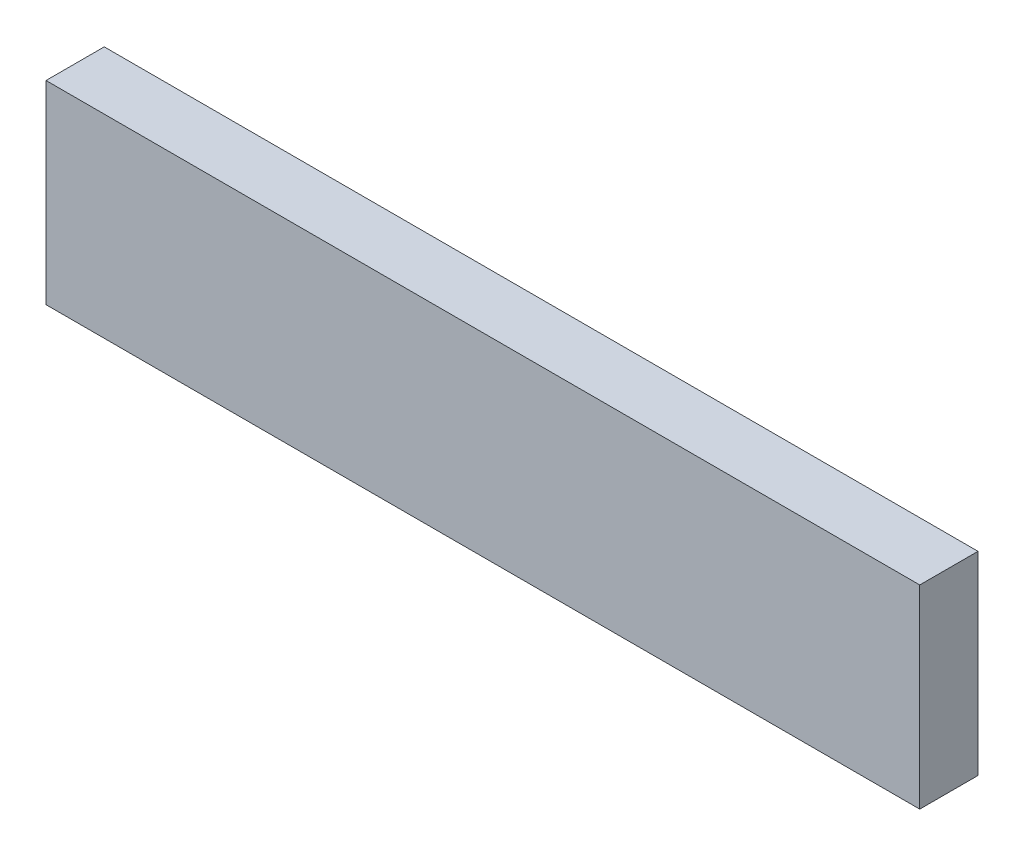
ISO-10303-21;
HEADER;
FILE_DESCRIPTION(('STEP AP214'),'2;1');
FILE_NAME('part.step','',(''),(''),'','','');
FILE_SCHEMA(('AUTOMOTIVE_DESIGN { 1 0 10303 214 1 1 1 1 }'));
ENDSEC;
DATA;
#1=APPLICATION_CONTEXT('core data for automotive mechanical design processes');
#2=APPLICATION_PROTOCOL_DEFINITION('international standard','automotive_design',2000,#1);
#3=PRODUCT_CONTEXT('',#1,'mechanical');
#4=PRODUCT('Part','Part','',(#3));
#5=PRODUCT_RELATED_PRODUCT_CATEGORY('part','',(#4));
#6=PRODUCT_DEFINITION_FORMATION('','',#4);
#7=PRODUCT_DEFINITION_CONTEXT('part definition',#1,'design');
#8=PRODUCT_DEFINITION('design','',#6,#7);
#9=PRODUCT_DEFINITION_SHAPE('','',#8);
#10=(LENGTH_UNIT() NAMED_UNIT(*) SI_UNIT(.MILLI.,.METRE.));
#11=(NAMED_UNIT(*) PLANE_ANGLE_UNIT() SI_UNIT($,.RADIAN.));
#12=(NAMED_UNIT(*) SI_UNIT($,.STERADIAN.) SOLID_ANGLE_UNIT());
#13=UNCERTAINTY_MEASURE_WITH_UNIT(LENGTH_MEASURE(1.E-05),#10,'distance_accuracy_value','');
#14=(GEOMETRIC_REPRESENTATION_CONTEXT(3) GLOBAL_UNCERTAINTY_ASSIGNED_CONTEXT((#13)) GLOBAL_UNIT_ASSIGNED_CONTEXT((#10,
#11,#12)) REPRESENTATION_CONTEXT('',''));
#15=CARTESIAN_POINT('',(0.,0.,0.));
#16=DIRECTION('',(0.,0.,1.));
#17=DIRECTION('',(1.,0.,0.));
#18=AXIS2_PLACEMENT_3D('',#15,#16,#17);
#19=CARTESIAN_POINT('',(-22.5,-5.,3.));
#20=DIRECTION('',(1.,0.,0.));
#21=DIRECTION('',(0.,0.,-1.));
#22=AXIS2_PLACEMENT_3D('',#19,#20,#21);
#23=PLANE('',#22);
#24=DIRECTION('',(0.,-1.,0.));
#25=VECTOR('',#24,1.);
#26=CARTESIAN_POINT('',(-22.5,-5.,0.));
#27=LINE('',#26,#25);
#28=CARTESIAN_POINT('',(-22.5,5.,0.));
#29=VERTEX_POINT('',#28);
#30=CARTESIAN_POINT('',(-22.5,-5.,0.));
#31=VERTEX_POINT('',#30);
#32=EDGE_CURVE('E96',#29,#31,#27,.T.);
#33=ORIENTED_EDGE('',*,*,#32,.T.);
#34=DIRECTION('',(0.,0.,-1.));
#35=VECTOR('',#34,1.);
#36=CARTESIAN_POINT('',(-22.5,-5.,3.));
#37=LINE('',#36,#35);
#38=CARTESIAN_POINT('',(-22.5,-5.,3.));
#39=VERTEX_POINT('',#38);
#40=EDGE_CURVE('E11',#39,#31,#37,.T.);
#41=ORIENTED_EDGE('',*,*,#40,.F.);
#42=DIRECTION('',(0.,-1.,0.));
#43=VECTOR('',#42,1.);
#44=CARTESIAN_POINT('',(-22.5,-5.,3.));
#45=LINE('',#44,#43);
#46=CARTESIAN_POINT('',(-22.5,5.,3.));
#47=VERTEX_POINT('',#46);
#48=EDGE_CURVE('E84',#47,#39,#45,.T.);
#49=ORIENTED_EDGE('',*,*,#48,.F.);
#50=DIRECTION('',(0.,0.,-1.));
#51=VECTOR('',#50,1.);
#52=CARTESIAN_POINT('',(-22.5,5.,3.));
#53=LINE('',#52,#51);
#54=EDGE_CURVE('E92',#47,#29,#53,.T.);
#55=ORIENTED_EDGE('',*,*,#54,.T.);
#56=EDGE_LOOP('',(#33,#41,#49,#55));
#57=FACE_BOUND('',#56,.T.);
#58=ADVANCED_FACE('F33',(#57),#23,.F.);
#59=CARTESIAN_POINT('',(22.5,-5.,3.));
#60=DIRECTION('',(0.,1.,0.));
#61=DIRECTION('',(-1.,0.,0.));
#62=AXIS2_PLACEMENT_3D('',#59,#60,#61);
#63=PLANE('',#62);
#64=DIRECTION('',(1.,0.,0.));
#65=VECTOR('',#64,1.);
#66=CARTESIAN_POINT('',(22.5,-5.,0.));
#67=LINE('',#66,#65);
#68=CARTESIAN_POINT('',(22.5,-5.,0.));
#69=VERTEX_POINT('',#68);
#70=EDGE_CURVE('E88',#31,#69,#67,.T.);
#71=ORIENTED_EDGE('',*,*,#70,.T.);
#72=DIRECTION('',(0.,0.,-1.));
#73=VECTOR('',#72,1.);
#74=CARTESIAN_POINT('',(22.5,-5.,3.));
#75=LINE('',#74,#73);
#76=CARTESIAN_POINT('',(22.5,-5.,3.));
#77=VERTEX_POINT('',#76);
#78=EDGE_CURVE('E41',#77,#69,#75,.T.);
#79=ORIENTED_EDGE('',*,*,#78,.F.);
#80=DIRECTION('',(1.,0.,0.));
#81=VECTOR('',#80,1.);
#82=CARTESIAN_POINT('',(22.5,-5.,3.));
#83=LINE('',#82,#81);
#84=EDGE_CURVE('E79',#39,#77,#83,.T.);
#85=ORIENTED_EDGE('',*,*,#84,.F.);
#86=ORIENTED_EDGE('',*,*,#40,.T.);
#87=EDGE_LOOP('',(#71,#79,#85,#86));
#88=FACE_BOUND('',#87,.T.);
#89=ADVANCED_FACE('F87',(#88),#63,.F.);
#90=CARTESIAN_POINT('',(22.5,-5.,3.));
#91=DIRECTION('',(-1.,0.,0.));
#92=DIRECTION('',(0.,0.,1.));
#93=AXIS2_PLACEMENT_3D('',#90,#91,#92);
#94=PLANE('',#93);
#95=DIRECTION('',(0.,1.,0.));
#96=VECTOR('',#95,1.);
#97=CARTESIAN_POINT('',(22.5,-5.,0.));
#98=LINE('',#97,#96);
#99=CARTESIAN_POINT('',(22.5,5.,0.));
#100=VERTEX_POINT('',#99);
#101=EDGE_CURVE('E66',#69,#100,#98,.T.);
#102=ORIENTED_EDGE('',*,*,#101,.T.);
#103=DIRECTION('',(0.,0.,-1.));
#104=VECTOR('',#103,1.);
#105=CARTESIAN_POINT('',(22.5,5.,3.));
#106=LINE('',#105,#104);
#107=CARTESIAN_POINT('',(22.5,5.,3.));
#108=VERTEX_POINT('',#107);
#109=EDGE_CURVE('E89',#108,#100,#106,.T.);
#110=ORIENTED_EDGE('',*,*,#109,.F.);
#111=DIRECTION('',(0.,1.,0.));
#112=VECTOR('',#111,1.);
#113=CARTESIAN_POINT('',(22.5,-5.,3.));
#114=LINE('',#113,#112);
#115=EDGE_CURVE('E82',#77,#108,#114,.T.);
#116=ORIENTED_EDGE('',*,*,#115,.F.);
#117=ORIENTED_EDGE('',*,*,#78,.T.);
#118=EDGE_LOOP('',(#102,#110,#116,#117));
#119=FACE_BOUND('',#118,.T.);
#120=ADVANCED_FACE('F90',(#119),#94,.F.);
#121=CARTESIAN_POINT('',(22.5,5.,3.));
#122=DIRECTION('',(0.,-1.,0.));
#123=DIRECTION('',(1.,0.,0.));
#124=AXIS2_PLACEMENT_3D('',#121,#122,#123);
#125=PLANE('',#124);
#126=DIRECTION('',(-1.,0.,0.));
#127=VECTOR('',#126,1.);
#128=CARTESIAN_POINT('',(22.5,5.,0.));
#129=LINE('',#128,#127);
#130=EDGE_CURVE('E72',#100,#29,#129,.T.);
#131=ORIENTED_EDGE('',*,*,#130,.T.);
#132=ORIENTED_EDGE('',*,*,#54,.F.);
#133=DIRECTION('',(-1.,0.,0.));
#134=VECTOR('',#133,1.);
#135=CARTESIAN_POINT('',(22.5,5.,3.));
#136=LINE('',#135,#134);
#137=EDGE_CURVE('E49',#108,#47,#136,.T.);
#138=ORIENTED_EDGE('',*,*,#137,.F.);
#139=ORIENTED_EDGE('',*,*,#109,.T.);
#140=EDGE_LOOP('',(#131,#132,#138,#139));
#141=FACE_BOUND('',#140,.T.);
#142=ADVANCED_FACE('F103',(#141),#125,.F.);
#143=CARTESIAN_POINT('',(0.,0.,3.));
#144=DIRECTION('',(0.,0.,1.));
#145=DIRECTION('',(1.,0.,0.));
#146=AXIS2_PLACEMENT_3D('',#143,#144,#145);
#147=PLANE('',#146);
#148=ORIENTED_EDGE('',*,*,#48,.T.);
#149=ORIENTED_EDGE('',*,*,#84,.T.);
#150=ORIENTED_EDGE('',*,*,#115,.T.);
#151=ORIENTED_EDGE('',*,*,#137,.T.);
#152=EDGE_LOOP('',(#148,#149,#150,#151));
#153=FACE_BOUND('',#152,.T.);
#154=ADVANCED_FACE('F80',(#153),#147,.T.);
#155=CARTESIAN_POINT('',(0.,0.,0.));
#156=DIRECTION('',(0.,0.,1.));
#157=DIRECTION('',(1.,0.,0.));
#158=AXIS2_PLACEMENT_3D('',#155,#156,#157);
#159=PLANE('',#158);
#160=ORIENTED_EDGE('',*,*,#32,.F.);
#161=ORIENTED_EDGE('',*,*,#130,.F.);
#162=ORIENTED_EDGE('',*,*,#101,.F.);
#163=ORIENTED_EDGE('',*,*,#70,.F.);
#164=EDGE_LOOP('',(#160,#161,#162,#163));
#165=FACE_BOUND('',#164,.T.);
#166=ADVANCED_FACE('F106',(#165),#159,.F.);
#167=CLOSED_SHELL('',(#58,#89,#120,#142,#154,#166));
#168=MANIFOLD_SOLID_BREP('B2',#167);
#169=ADVANCED_BREP_SHAPE_REPRESENTATION('',(#18,#168),#14);
#170=SHAPE_DEFINITION_REPRESENTATION(#9,#169);
ENDSEC;
END-ISO-10303-21;
